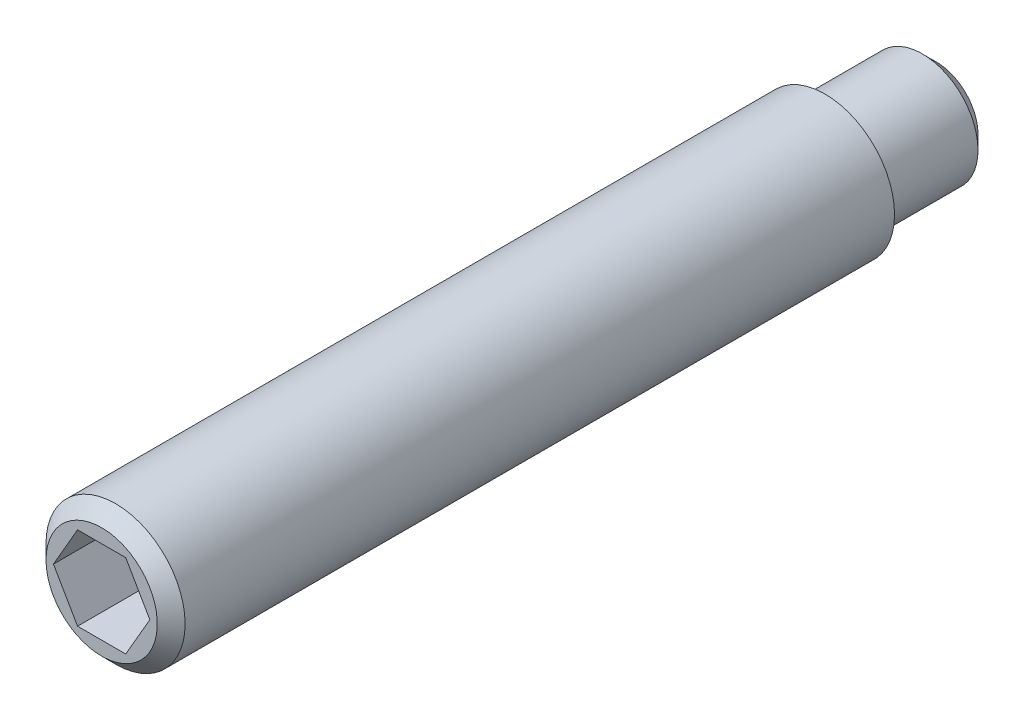
ISO-10303-21;
HEADER;
FILE_DESCRIPTION(('STEP AP214'),'2;1');
FILE_NAME('part.step','',(''),(''),'','','');
FILE_SCHEMA(('AUTOMOTIVE_DESIGN { 1 0 10303 214 1 1 1 1 }'));
ENDSEC;
DATA;
#1=APPLICATION_CONTEXT('core data for automotive mechanical design processes');
#2=APPLICATION_PROTOCOL_DEFINITION('international standard','automotive_design',2000,#1);
#3=PRODUCT_CONTEXT('',#1,'mechanical');
#4=PRODUCT('Part','Part','',(#3));
#5=PRODUCT_RELATED_PRODUCT_CATEGORY('part','',(#4));
#6=PRODUCT_DEFINITION_FORMATION('','',#4);
#7=PRODUCT_DEFINITION_CONTEXT('part definition',#1,'design');
#8=PRODUCT_DEFINITION('design','',#6,#7);
#9=PRODUCT_DEFINITION_SHAPE('','',#8);
#10=(LENGTH_UNIT() NAMED_UNIT(*) SI_UNIT(.MILLI.,.METRE.));
#11=(NAMED_UNIT(*) PLANE_ANGLE_UNIT() SI_UNIT($,.RADIAN.));
#12=(NAMED_UNIT(*) SI_UNIT($,.STERADIAN.) SOLID_ANGLE_UNIT());
#13=UNCERTAINTY_MEASURE_WITH_UNIT(LENGTH_MEASURE(1.E-05),#10,'distance_accuracy_value','');
#14=(GEOMETRIC_REPRESENTATION_CONTEXT(3) GLOBAL_UNCERTAINTY_ASSIGNED_CONTEXT((#13)) GLOBAL_UNIT_ASSIGNED_CONTEXT((#10,
#11,#12)) REPRESENTATION_CONTEXT('',''));
#15=CARTESIAN_POINT('',(0.,0.,0.));
#16=DIRECTION('',(0.,0.,1.));
#17=DIRECTION('',(1.,0.,0.));
#18=AXIS2_PLACEMENT_3D('',#15,#16,#17);
#19=CARTESIAN_POINT('',(0.866025403784438,1.5,-4.));
#20=DIRECTION('',(0.,1.,0.));
#21=DIRECTION('',(0.,0.,1.));
#22=AXIS2_PLACEMENT_3D('',#19,#20,#21);
#23=PLANE('',#22);
#24=DIRECTION('',(0.,0.,1.));
#25=VECTOR('',#24,1.);
#26=CARTESIAN_POINT('',(-0.866025403784439,1.5,-4.));
#27=LINE('',#26,#25);
#28=CARTESIAN_POINT('',(-0.866025403784439,1.5,0.));
#29=VERTEX_POINT('',#28);
#30=CARTESIAN_POINT('',(-0.866025403784439,1.5,-4.));
#31=VERTEX_POINT('',#30);
#32=EDGE_CURVE('E82',#29,#31,#27,.F.);
#33=ORIENTED_EDGE('',*,*,#32,.T.);
#34=DIRECTION('',(1.,0.,0.));
#35=VECTOR('',#34,1.);
#36=CARTESIAN_POINT('',(0.866025403784438,1.5,-4.));
#37=LINE('',#36,#35);
#38=CARTESIAN_POINT('',(0.866025403784438,1.5,-4.));
#39=VERTEX_POINT('',#38);
#40=EDGE_CURVE('E71',#39,#31,#37,.F.);
#41=ORIENTED_EDGE('',*,*,#40,.F.);
#42=DIRECTION('',(0.,0.,1.));
#43=VECTOR('',#42,1.);
#44=CARTESIAN_POINT('',(0.866025403784438,1.5,-4.));
#45=LINE('',#44,#43);
#46=CARTESIAN_POINT('',(0.866025403784438,1.5,0.));
#47=VERTEX_POINT('',#46);
#48=EDGE_CURVE('E90',#39,#47,#45,.T.);
#49=ORIENTED_EDGE('',*,*,#48,.T.);
#50=DIRECTION('',(1.,0.,0.));
#51=VECTOR('',#50,1.);
#52=CARTESIAN_POINT('',(0.866025403784438,1.5,0.));
#53=LINE('',#52,#51);
#54=EDGE_CURVE('E66',#29,#47,#53,.T.);
#55=ORIENTED_EDGE('',*,*,#54,.F.);
#56=EDGE_LOOP('',(#33,#41,#49,#55));
#57=FACE_BOUND('',#56,.T.);
#58=ADVANCED_FACE('F16',(#57),#23,.F.);
#59=CARTESIAN_POINT('',(-0.866025403784439,1.5,-4.));
#60=DIRECTION('',(-0.866025403784439,0.5,0.));
#61=DIRECTION('',(-0.5,-0.866025403784439,0.));
#62=AXIS2_PLACEMENT_3D('',#59,#60,#61);
#63=PLANE('',#62);
#64=DIRECTION('',(0.,0.,1.));
#65=VECTOR('',#64,1.);
#66=CARTESIAN_POINT('',(-1.73205080756888,0.,-4.));
#67=LINE('',#66,#65);
#68=CARTESIAN_POINT('',(-1.73205080756888,0.,0.));
#69=VERTEX_POINT('',#68);
#70=CARTESIAN_POINT('',(-1.73205080756888,0.,-4.));
#71=VERTEX_POINT('',#70);
#72=EDGE_CURVE('E86',#69,#71,#67,.F.);
#73=ORIENTED_EDGE('',*,*,#72,.T.);
#74=DIRECTION('',(-0.5,-0.866025403784439,0.));
#75=VECTOR('',#74,1.);
#76=CARTESIAN_POINT('',(-0.866025403784439,1.5,-4.));
#77=LINE('',#76,#75);
#78=EDGE_CURVE('E75',#31,#71,#77,.T.);
#79=ORIENTED_EDGE('',*,*,#78,.F.);
#80=ORIENTED_EDGE('',*,*,#32,.F.);
#81=DIRECTION('',(-0.5,-0.866025403784439,0.));
#82=VECTOR('',#81,1.);
#83=CARTESIAN_POINT('',(-0.866025403784439,1.5,0.));
#84=LINE('',#83,#82);
#85=EDGE_CURVE('E88',#69,#29,#84,.F.);
#86=ORIENTED_EDGE('',*,*,#85,.F.);
#87=EDGE_LOOP('',(#73,#79,#80,#86));
#88=FACE_BOUND('',#87,.T.);
#89=ADVANCED_FACE('F85',(#88),#63,.F.);
#90=CARTESIAN_POINT('',(1.73205080756888,0.,-4.));
#91=DIRECTION('',(0.866025403784439,0.5,0.));
#92=DIRECTION('',(-0.5,0.866025403784439,0.));
#93=AXIS2_PLACEMENT_3D('',#90,#91,#92);
#94=PLANE('',#93);
#95=ORIENTED_EDGE('',*,*,#48,.F.);
#96=DIRECTION('',(-0.5,0.866025403784438,0.));
#97=VECTOR('',#96,1.);
#98=CARTESIAN_POINT('',(1.73205080756888,0.,-4.));
#99=LINE('',#98,#97);
#100=CARTESIAN_POINT('',(1.73205080756888,0.,-4.));
#101=VERTEX_POINT('',#100);
#102=EDGE_CURVE('E78',#101,#39,#99,.T.);
#103=ORIENTED_EDGE('',*,*,#102,.F.);
#104=DIRECTION('',(0.,0.,1.));
#105=VECTOR('',#104,1.);
#106=CARTESIAN_POINT('',(1.73205080756888,0.,-4.));
#107=LINE('',#106,#105);
#108=CARTESIAN_POINT('',(1.73205080756888,0.,0.));
#109=VERTEX_POINT('',#108);
#110=EDGE_CURVE('E122',#101,#109,#107,.T.);
#111=ORIENTED_EDGE('',*,*,#110,.T.);
#112=DIRECTION('',(-0.5,0.866025403784439,0.));
#113=VECTOR('',#112,1.);
#114=CARTESIAN_POINT('',(1.73205080756888,0.,0.));
#115=LINE('',#114,#113);
#116=EDGE_CURVE('E132',#47,#109,#115,.F.);
#117=ORIENTED_EDGE('',*,*,#116,.F.);
#118=EDGE_LOOP('',(#95,#103,#111,#117));
#119=FACE_BOUND('',#118,.T.);
#120=ADVANCED_FACE('F135',(#119),#94,.F.);
#121=CARTESIAN_POINT('',(0.,0.,-30.));
#122=DIRECTION('',(0.,0.,1.));
#123=DIRECTION('',(1.,0.,0.));
#124=AXIS2_PLACEMENT_3D('',#121,#122,#123);
#125=PLANE('',#124);
#126=CARTESIAN_POINT('',(0.,0.,-30.0000000000296));
#127=DIRECTION('',(0.,0.,1.));
#128=DIRECTION('',(0.,-1.,0.));
#129=AXIS2_PLACEMENT_3D('',#126,#127,#128);
#130=CIRCLE('',#129,1.50000000002137);
#131=CARTESIAN_POINT('',(0.,-1.50000000002137,-30.0000000000296));
#132=VERTEX_POINT('',#131);
#133=EDGE_CURVE('E19',#132,#132,#130,.T.);
#134=ORIENTED_EDGE('',*,*,#133,.F.);
#135=EDGE_LOOP('',(#134));
#136=FACE_BOUND('',#135,.T.);
#137=ADVANCED_FACE('F242',(#136),#125,.F.);
#138=CARTESIAN_POINT('',(-1.73205080756888,0.,-4.));
#139=DIRECTION('',(-0.866025403784438,-0.5,0.));
#140=DIRECTION('',(0.5,-0.866025403784438,0.));
#141=AXIS2_PLACEMENT_3D('',#138,#139,#140);
#142=PLANE('',#141);
#143=DIRECTION('',(0.,0.,1.));
#144=VECTOR('',#143,1.);
#145=CARTESIAN_POINT('',(-0.866025403784438,-1.5,-4.));
#146=LINE('',#145,#144);
#147=CARTESIAN_POINT('',(-0.866025403784438,-1.5,0.));
#148=VERTEX_POINT('',#147);
#149=CARTESIAN_POINT('',(-0.866025403784438,-1.5,-4.));
#150=VERTEX_POINT('',#149);
#151=EDGE_CURVE('E118',#148,#150,#146,.F.);
#152=ORIENTED_EDGE('',*,*,#151,.T.);
#153=DIRECTION('',(0.5,-0.866025403784438,0.));
#154=VECTOR('',#153,1.);
#155=CARTESIAN_POINT('',(-1.73205080756888,0.,-4.));
#156=LINE('',#155,#154);
#157=EDGE_CURVE('E128',#71,#150,#156,.T.);
#158=ORIENTED_EDGE('',*,*,#157,.F.);
#159=ORIENTED_EDGE('',*,*,#72,.F.);
#160=DIRECTION('',(0.5,-0.866025403784438,0.));
#161=VECTOR('',#160,1.);
#162=CARTESIAN_POINT('',(-1.73205080756888,0.,0.));
#163=LINE('',#162,#161);
#164=EDGE_CURVE('E34',#148,#69,#163,.F.);
#165=ORIENTED_EDGE('',*,*,#164,.F.);
#166=EDGE_LOOP('',(#152,#158,#159,#165));
#167=FACE_BOUND('',#166,.T.);
#168=ADVANCED_FACE('F140',(#167),#142,.F.);
#169=CARTESIAN_POINT('',(0.,0.,-4.));
#170=DIRECTION('',(0.,0.,1.));
#171=DIRECTION('',(1.,0.,0.));
#172=AXIS2_PLACEMENT_3D('',#169,#170,#171);
#173=PLANE('',#172);
#174=ORIENTED_EDGE('',*,*,#40,.T.);
#175=ORIENTED_EDGE('',*,*,#78,.T.);
#176=ORIENTED_EDGE('',*,*,#157,.T.);
#177=DIRECTION('',(1.,0.,0.));
#178=VECTOR('',#177,1.);
#179=CARTESIAN_POINT('',(-0.866025403784438,-1.5,-4.));
#180=LINE('',#179,#178);
#181=CARTESIAN_POINT('',(0.86602540378444,-1.5,-4.));
#182=VERTEX_POINT('',#181);
#183=EDGE_CURVE('E116',#150,#182,#180,.T.);
#184=ORIENTED_EDGE('',*,*,#183,.T.);
#185=DIRECTION('',(0.5,0.866025403784439,0.));
#186=VECTOR('',#185,1.);
#187=CARTESIAN_POINT('',(0.86602540378444,-1.5,-4.));
#188=LINE('',#187,#186);
#189=EDGE_CURVE('E125',#182,#101,#188,.T.);
#190=ORIENTED_EDGE('',*,*,#189,.T.);
#191=ORIENTED_EDGE('',*,*,#102,.T.);
#192=EDGE_LOOP('',(#174,#175,#176,#184,#190,#191));
#193=FACE_BOUND('',#192,.T.);
#194=ADVANCED_FACE('F72',(#193),#173,.T.);
#195=CARTESIAN_POINT('',(0.86602540378444,-1.5,-4.));
#196=DIRECTION('',(0.866025403784439,-0.5,0.));
#197=DIRECTION('',(0.5,0.866025403784439,0.));
#198=AXIS2_PLACEMENT_3D('',#195,#196,#197);
#199=PLANE('',#198);
#200=ORIENTED_EDGE('',*,*,#110,.F.);
#201=ORIENTED_EDGE('',*,*,#189,.F.);
#202=DIRECTION('',(0.,0.,1.));
#203=VECTOR('',#202,1.);
#204=CARTESIAN_POINT('',(0.86602540378444,-1.5,-4.));
#205=LINE('',#204,#203);
#206=CARTESIAN_POINT('',(0.86602540378444,-1.5,0.));
#207=VERTEX_POINT('',#206);
#208=EDGE_CURVE('E111',#182,#207,#205,.T.);
#209=ORIENTED_EDGE('',*,*,#208,.T.);
#210=DIRECTION('',(0.5,0.866025403784439,0.));
#211=VECTOR('',#210,1.);
#212=CARTESIAN_POINT('',(0.86602540378444,-1.5,0.));
#213=LINE('',#212,#211);
#214=EDGE_CURVE('E120',#109,#207,#213,.F.);
#215=ORIENTED_EDGE('',*,*,#214,.F.);
#216=EDGE_LOOP('',(#200,#201,#209,#215));
#217=FACE_BOUND('',#216,.T.);
#218=ADVANCED_FACE('F145',(#217),#199,.F.);
#219=CARTESIAN_POINT('',(0.,0.,-29.5000000000982));
#220=DIRECTION('',(0.,0.,1.));
#221=DIRECTION('',(0.,-1.,0.));
#222=AXIS2_PLACEMENT_3D('',#219,#220,#221);
#223=CONICAL_SURFACE('',#222,1.99999999995271,0.785398163397448);
#224=CARTESIAN_POINT('',(0.,0.,-29.5));
#225=DIRECTION('',(0.,0.,1.));
#226=DIRECTION('',(1.,0.,0.));
#227=AXIS2_PLACEMENT_3D('',#224,#225,#226);
#228=CIRCLE('',#227,2.);
#229=CARTESIAN_POINT('',(2.,0.,-29.5));
#230=VERTEX_POINT('',#229);
#231=EDGE_CURVE('E105',#230,#230,#228,.T.);
#232=ORIENTED_EDGE('',*,*,#231,.F.);
#233=EDGE_LOOP('',(#232));
#234=FACE_BOUND('',#233,.T.);
#235=ORIENTED_EDGE('',*,*,#133,.T.);
#236=EDGE_LOOP('',(#235));
#237=FACE_BOUND('',#236,.T.);
#238=ADVANCED_FACE('F147',(#234,#237),#223,.T.);
#239=CARTESIAN_POINT('',(-0.866025403784438,-1.5,-4.));
#240=DIRECTION('',(0.,-1.,0.));
#241=DIRECTION('',(1.,0.,0.));
#242=AXIS2_PLACEMENT_3D('',#239,#240,#241);
#243=PLANE('',#242);
#244=ORIENTED_EDGE('',*,*,#208,.F.);
#245=ORIENTED_EDGE('',*,*,#183,.F.);
#246=ORIENTED_EDGE('',*,*,#151,.F.);
#247=DIRECTION('',(-1.,0.,0.));
#248=VECTOR('',#247,1.);
#249=CARTESIAN_POINT('',(0.,-1.5,0.));
#250=LINE('',#249,#248);
#251=EDGE_CURVE('E101',#148,#207,#250,.F.);
#252=ORIENTED_EDGE('',*,*,#251,.T.);
#253=EDGE_LOOP('',(#244,#245,#246,#252));
#254=FACE_BOUND('',#253,.T.);
#255=ADVANCED_FACE('F143',(#254),#243,.F.);
#256=CARTESIAN_POINT('',(0.,0.,0.));
#257=DIRECTION('',(0.,0.,1.));
#258=DIRECTION('',(1.,0.,0.));
#259=AXIS2_PLACEMENT_3D('',#256,#257,#258);
#260=CYLINDRICAL_SURFACE('',#259,2.);
#261=CARTESIAN_POINT('',(0.,0.,-26.));
#262=DIRECTION('',(0.,0.,1.));
#263=DIRECTION('',(1.,0.,0.));
#264=AXIS2_PLACEMENT_3D('',#261,#262,#263);
#265=CIRCLE('',#264,2.);
#266=CARTESIAN_POINT('',(2.,0.,-26.));
#267=VERTEX_POINT('',#266);
#268=EDGE_CURVE('E99',#267,#267,#265,.F.);
#269=ORIENTED_EDGE('',*,*,#268,.T.);
#270=EDGE_LOOP('',(#269));
#271=FACE_BOUND('',#270,.T.);
#272=ORIENTED_EDGE('',*,*,#231,.T.);
#273=EDGE_LOOP('',(#272));
#274=FACE_BOUND('',#273,.T.);
#275=ADVANCED_FACE('F175',(#271,#274),#260,.T.);
#276=CARTESIAN_POINT('',(0.,2.,0.));
#277=DIRECTION('',(0.,0.,-1.));
#278=DIRECTION('',(-1.,0.,0.));
#279=AXIS2_PLACEMENT_3D('',#276,#277,#278);
#280=PLANE('',#279);
#281=CARTESIAN_POINT('',(0.,0.,0.));
#282=DIRECTION('',(0.,0.,-1.));
#283=DIRECTION('',(-1.,0.,0.));
#284=AXIS2_PLACEMENT_3D('',#281,#282,#283);
#285=CIRCLE('',#284,2.00000000000955);
#286=CARTESIAN_POINT('',(-2.00000000000955,0.,0.));
#287=VERTEX_POINT('',#286);
#288=EDGE_CURVE('E97',#287,#287,#285,.T.);
#289=ORIENTED_EDGE('',*,*,#288,.F.);
#290=EDGE_LOOP('',(#289));
#291=FACE_BOUND('',#290,.T.);
#292=ORIENTED_EDGE('',*,*,#164,.T.);
#293=ORIENTED_EDGE('',*,*,#85,.T.);
#294=ORIENTED_EDGE('',*,*,#54,.T.);
#295=ORIENTED_EDGE('',*,*,#116,.T.);
#296=ORIENTED_EDGE('',*,*,#214,.T.);
#297=ORIENTED_EDGE('',*,*,#251,.F.);
#298=EDGE_LOOP('',(#292,#293,#294,#295,#296,#297));
#299=FACE_BOUND('',#298,.T.);
#300=ADVANCED_FACE('F139',(#291,#299),#280,.F.);
#301=CARTESIAN_POINT('',(0.,2.,-26.));
#302=DIRECTION('',(0.,0.,1.));
#303=DIRECTION('',(1.,0.,0.));
#304=AXIS2_PLACEMENT_3D('',#301,#302,#303);
#305=PLANE('',#304);
#306=ORIENTED_EDGE('',*,*,#268,.F.);
#307=EDGE_LOOP('',(#306));
#308=FACE_BOUND('',#307,.T.);
#309=CARTESIAN_POINT('',(0.,0.,-26.));
#310=DIRECTION('',(0.,0.,1.));
#311=DIRECTION('',(1.,0.,0.));
#312=AXIS2_PLACEMENT_3D('',#309,#310,#311);
#313=CIRCLE('',#312,2.5);
#314=CARTESIAN_POINT('',(2.5,0.,-26.));
#315=VERTEX_POINT('',#314);
#316=EDGE_CURVE('E25',#315,#315,#313,.T.);
#317=ORIENTED_EDGE('',*,*,#316,.F.);
#318=EDGE_LOOP('',(#317));
#319=FACE_BOUND('',#318,.T.);
#320=ADVANCED_FACE('F165',(#308,#319),#305,.F.);
#321=CARTESIAN_POINT('',(0.,0.,-0.499999999931333));
#322=DIRECTION('',(0.,0.,-1.));
#323=DIRECTION('',(-1.,0.,0.));
#324=AXIS2_PLACEMENT_3D('',#321,#322,#323);
#325=CONICAL_SURFACE('',#324,2.49999999988404,0.785398163340605);
#326=CARTESIAN_POINT('',(0.,0.,-0.5));
#327=DIRECTION('',(0.,0.,1.));
#328=DIRECTION('',(1.,0.,0.));
#329=AXIS2_PLACEMENT_3D('',#326,#327,#328);
#330=CIRCLE('',#329,2.5);
#331=CARTESIAN_POINT('',(2.5,0.,-0.5));
#332=VERTEX_POINT('',#331);
#333=EDGE_CURVE('E11',#332,#332,#330,.F.);
#334=ORIENTED_EDGE('',*,*,#333,.F.);
#335=EDGE_LOOP('',(#334));
#336=FACE_BOUND('',#335,.T.);
#337=ORIENTED_EDGE('',*,*,#288,.T.);
#338=EDGE_LOOP('',(#337));
#339=FACE_BOUND('',#338,.T.);
#340=ADVANCED_FACE('F159',(#336,#339),#325,.T.);
#341=CARTESIAN_POINT('',(0.,0.,0.));
#342=DIRECTION('',(0.,0.,1.));
#343=DIRECTION('',(1.,0.,0.));
#344=AXIS2_PLACEMENT_3D('',#341,#342,#343);
#345=CYLINDRICAL_SURFACE('',#344,2.5);
#346=ORIENTED_EDGE('',*,*,#333,.T.);
#347=EDGE_LOOP('',(#346));
#348=FACE_BOUND('',#347,.T.);
#349=ORIENTED_EDGE('',*,*,#316,.T.);
#350=EDGE_LOOP('',(#349));
#351=FACE_BOUND('',#350,.T.);
#352=ADVANCED_FACE('F157',(#348,#351),#345,.T.);
#353=CLOSED_SHELL('',(#58,#89,#120,#137,#168,#194,#218,#238,#255,#275,#300,#320,#340,#352));
#354=MANIFOLD_SOLID_BREP('B1',#353);
#355=ADVANCED_BREP_SHAPE_REPRESENTATION('',(#18,#354),#14);
#356=SHAPE_DEFINITION_REPRESENTATION(#9,#355);
ENDSEC;
END-ISO-10303-21;
